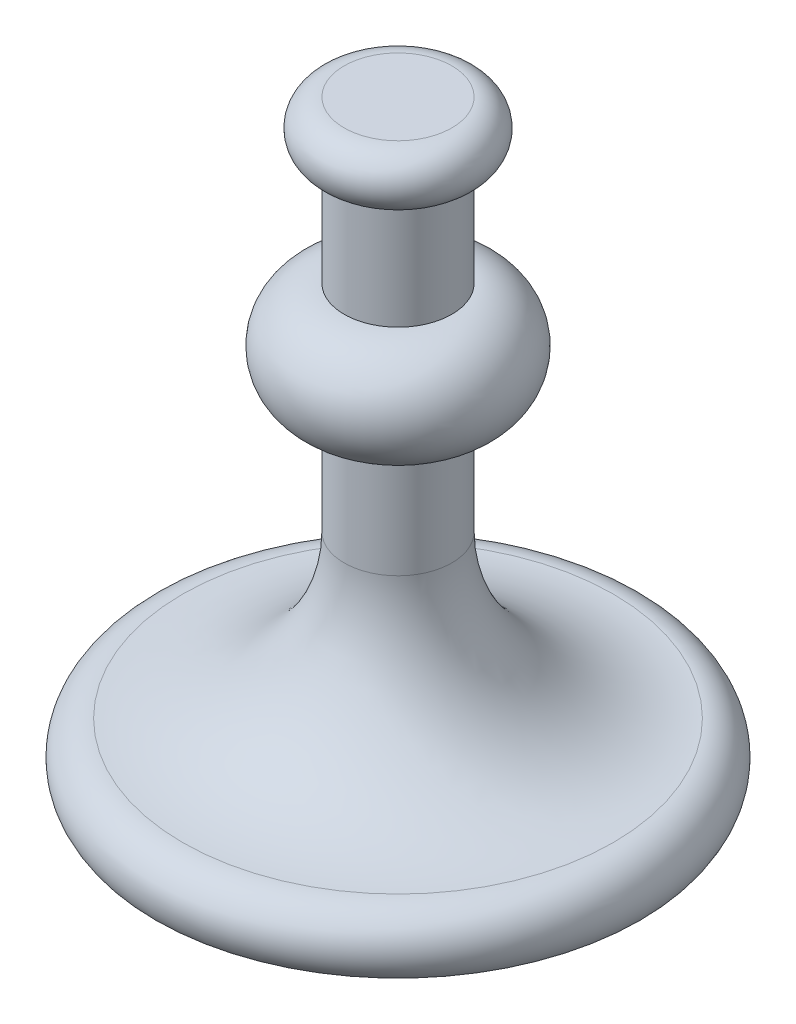
ISO-10303-21;
HEADER;
FILE_DESCRIPTION(('STEP AP214'),'2;1');
FILE_NAME('part.step','',(''),(''),'','','');
FILE_SCHEMA(('AUTOMOTIVE_DESIGN { 1 0 10303 214 1 1 1 1 }'));
ENDSEC;
DATA;
#1=APPLICATION_CONTEXT('core data for automotive mechanical design processes');
#2=APPLICATION_PROTOCOL_DEFINITION('international standard','automotive_design',2000,#1);
#3=PRODUCT_CONTEXT('',#1,'mechanical');
#4=PRODUCT('Part','Part','',(#3));
#5=PRODUCT_RELATED_PRODUCT_CATEGORY('part','',(#4));
#6=PRODUCT_DEFINITION_FORMATION('','',#4);
#7=PRODUCT_DEFINITION_CONTEXT('part definition',#1,'design');
#8=PRODUCT_DEFINITION('design','',#6,#7);
#9=PRODUCT_DEFINITION_SHAPE('','',#8);
#10=(LENGTH_UNIT() NAMED_UNIT(*) SI_UNIT(.MILLI.,.METRE.));
#11=(NAMED_UNIT(*) PLANE_ANGLE_UNIT() SI_UNIT($,.RADIAN.));
#12=(NAMED_UNIT(*) SI_UNIT($,.STERADIAN.) SOLID_ANGLE_UNIT());
#13=UNCERTAINTY_MEASURE_WITH_UNIT(LENGTH_MEASURE(1.E-05),#10,'distance_accuracy_value','');
#14=(GEOMETRIC_REPRESENTATION_CONTEXT(3) GLOBAL_UNCERTAINTY_ASSIGNED_CONTEXT((#13)) GLOBAL_UNIT_ASSIGNED_CONTEXT((#10,
#11,#12)) REPRESENTATION_CONTEXT('',''));
#15=CARTESIAN_POINT('',(0.,0.,0.));
#16=DIRECTION('',(0.,0.,1.));
#17=DIRECTION('',(1.,0.,0.));
#18=AXIS2_PLACEMENT_3D('',#15,#16,#17);
#19=CARTESIAN_POINT('',(0.,0.,0.));
#20=DIRECTION('',(0.,-1.,0.));
#21=DIRECTION('',(0.,0.,-1.));
#22=AXIS2_PLACEMENT_3D('',#19,#20,#21);
#23=PLANE('',#22);
#24=CARTESIAN_POINT('',(0.,0.,0.));
#25=DIRECTION('',(0.,-1.,0.));
#26=DIRECTION('',(0.,0.,-1.));
#27=AXIS2_PLACEMENT_3D('',#24,#25,#26);
#28=CIRCLE('',#27,90.);
#29=CARTESIAN_POINT('',(0.,0.,-90.));
#30=VERTEX_POINT('',#29);
#31=EDGE_CURVE('E59',#30,#30,#28,.T.);
#32=ORIENTED_EDGE('',*,*,#31,.T.);
#33=EDGE_LOOP('',(#32));
#34=FACE_BOUND('',#33,.T.);
#35=ADVANCED_FACE('F34',(#34),#23,.T.);
#36=CARTESIAN_POINT('',(0.,220.,0.));
#37=DIRECTION('',(0.,1.,0.));
#38=DIRECTION('',(0.,0.,1.));
#39=AXIS2_PLACEMENT_3D('',#36,#37,#38);
#40=PLANE('',#39);
#41=CARTESIAN_POINT('',(0.,220.,0.));
#42=DIRECTION('',(0.,-1.,0.));
#43=DIRECTION('',(0.,0.,-1.));
#44=AXIS2_PLACEMENT_3D('',#41,#42,#43);
#45=CIRCLE('',#44,20.);
#46=CARTESIAN_POINT('',(0.,220.,-20.));
#47=VERTEX_POINT('',#46);
#48=EDGE_CURVE('E10',#47,#47,#45,.T.);
#49=ORIENTED_EDGE('',*,*,#48,.F.);
#50=EDGE_LOOP('',(#49));
#51=FACE_BOUND('',#50,.T.);
#52=ADVANCED_FACE('F76',(#51),#40,.T.);
#53=CARTESIAN_POINT('',(0.,210.,0.));
#54=DIRECTION('',(0.,-1.,0.));
#55=DIRECTION('',(0.,0.,-1.));
#56=AXIS2_PLACEMENT_3D('',#53,#54,#55);
#57=TOROIDAL_SURFACE('',#56,20.,10.);
#58=ORIENTED_EDGE('',*,*,#48,.T.);
#59=EDGE_LOOP('',(#58));
#60=FACE_BOUND('',#59,.T.);
#61=CARTESIAN_POINT('',(0.,200.,0.));
#62=DIRECTION('',(0.,-1.,0.));
#63=DIRECTION('',(0.,0.,-1.));
#64=AXIS2_PLACEMENT_3D('',#61,#62,#63);
#65=CIRCLE('',#64,20.);
#66=CARTESIAN_POINT('',(0.,200.,-20.));
#67=VERTEX_POINT('',#66);
#68=EDGE_CURVE('E40',#67,#67,#65,.T.);
#69=ORIENTED_EDGE('',*,*,#68,.F.);
#70=EDGE_LOOP('',(#69));
#71=FACE_BOUND('',#70,.T.);
#72=ADVANCED_FACE('F80',(#60,#71),#57,.T.);
#73=CARTESIAN_POINT('',(0.,220.,0.));
#74=DIRECTION('',(0.,-1.,0.));
#75=DIRECTION('',(0.,0.,-1.));
#76=AXIS2_PLACEMENT_3D('',#73,#74,#75);
#77=CYLINDRICAL_SURFACE('',#76,20.);
#78=ORIENTED_EDGE('',*,*,#68,.T.);
#79=EDGE_LOOP('',(#78));
#80=FACE_BOUND('',#79,.T.);
#81=CARTESIAN_POINT('',(0.,160.,0.));
#82=DIRECTION('',(0.,-1.,0.));
#83=DIRECTION('',(0.,0.,-1.));
#84=AXIS2_PLACEMENT_3D('',#81,#82,#83);
#85=CIRCLE('',#84,20.);
#86=CARTESIAN_POINT('',(0.,160.,-20.));
#87=VERTEX_POINT('',#86);
#88=EDGE_CURVE('E44',#87,#87,#85,.T.);
#89=ORIENTED_EDGE('',*,*,#88,.F.);
#90=EDGE_LOOP('',(#89));
#91=FACE_BOUND('',#90,.T.);
#92=ADVANCED_FACE('F85',(#80,#91),#77,.T.);
#93=CARTESIAN_POINT('',(0.,140.,0.));
#94=DIRECTION('',(0.,-1.,0.));
#95=DIRECTION('',(0.,0.,-1.));
#96=AXIS2_PLACEMENT_3D('',#93,#94,#95);
#97=DEGENERATE_TOROIDAL_SURFACE('',#96,20.,20.,.T.);
#98=ORIENTED_EDGE('',*,*,#88,.T.);
#99=EDGE_LOOP('',(#98));
#100=FACE_BOUND('',#99,.T.);
#101=CARTESIAN_POINT('',(0.,120.,0.));
#102=DIRECTION('',(0.,-1.,0.));
#103=DIRECTION('',(0.,0.,-1.));
#104=AXIS2_PLACEMENT_3D('',#101,#102,#103);
#105=CIRCLE('',#104,20.);
#106=CARTESIAN_POINT('',(0.,120.,-20.));
#107=VERTEX_POINT('',#106);
#108=EDGE_CURVE('E48',#107,#107,#105,.T.);
#109=ORIENTED_EDGE('',*,*,#108,.F.);
#110=EDGE_LOOP('',(#109));
#111=FACE_BOUND('',#110,.T.);
#112=ADVANCED_FACE('F90',(#100,#111),#97,.T.);
#113=CARTESIAN_POINT('',(0.,220.,0.));
#114=DIRECTION('',(0.,-1.,0.));
#115=DIRECTION('',(0.,0.,-1.));
#116=AXIS2_PLACEMENT_3D('',#113,#114,#115);
#117=CYLINDRICAL_SURFACE('',#116,20.);
#118=ORIENTED_EDGE('',*,*,#108,.T.);
#119=EDGE_LOOP('',(#118));
#120=FACE_BOUND('',#119,.T.);
#121=CARTESIAN_POINT('',(0.,80.0012637843949,0.));
#122=DIRECTION('',(0.,-1.,0.));
#123=DIRECTION('',(0.,0.,-1.));
#124=AXIS2_PLACEMENT_3D('',#121,#122,#123);
#125=CIRCLE('',#124,20.);
#126=CARTESIAN_POINT('',(0.,80.0012637843949,-20.));
#127=VERTEX_POINT('',#126);
#128=EDGE_CURVE('E53',#127,#127,#125,.T.);
#129=ORIENTED_EDGE('',*,*,#128,.F.);
#130=EDGE_LOOP('',(#129));
#131=FACE_BOUND('',#130,.T.);
#132=ADVANCED_FACE('F72',(#120,#131),#117,.T.);
#133=CARTESIAN_POINT('',(0.,80.0012637843949,0.));
#134=DIRECTION('',(0.,-1.,0.));
#135=DIRECTION('',(0.,0.,-1.));
#136=AXIS2_PLACEMENT_3D('',#133,#134,#135);
#137=TOROIDAL_SURFACE('',#136,80.,60.);
#138=ORIENTED_EDGE('',*,*,#128,.T.);
#139=EDGE_LOOP('',(#138));
#140=FACE_BOUND('',#139,.T.);
#141=CARTESIAN_POINT('',(0.,20.0012637843948,0.));
#142=DIRECTION('',(0.,-1.,0.));
#143=DIRECTION('',(0.,0.,-1.));
#144=AXIS2_PLACEMENT_3D('',#141,#142,#143);
#145=CIRCLE('',#144,80.);
#146=CARTESIAN_POINT('',(0.,20.0012637843948,-80.));
#147=VERTEX_POINT('',#146);
#148=EDGE_CURVE('E56',#147,#147,#145,.T.);
#149=ORIENTED_EDGE('',*,*,#148,.F.);
#150=EDGE_LOOP('',(#149));
#151=FACE_BOUND('',#150,.T.);
#152=ADVANCED_FACE('F66',(#140,#151),#137,.F.);
#153=CARTESIAN_POINT('',(0.,7.50078985526522,0.));
#154=DIRECTION('',(0.,-1.,0.));
#155=DIRECTION('',(0.,0.,-1.));
#156=AXIS2_PLACEMENT_3D('',#153,#154,#155);
#157=TOROIDAL_SURFACE('',#156,80.,12.5004739291296);
#158=ORIENTED_EDGE('',*,*,#148,.T.);
#159=EDGE_LOOP('',(#158));
#160=FACE_BOUND('',#159,.T.);
#161=ORIENTED_EDGE('',*,*,#31,.F.);
#162=EDGE_LOOP('',(#161));
#163=FACE_BOUND('',#162,.T.);
#164=ADVANCED_FACE('F64',(#160,#163),#157,.T.);
#165=CLOSED_SHELL('',(#35,#52,#72,#92,#112,#132,#152,#164));
#166=MANIFOLD_SOLID_BREP('B2',#165);
#167=ADVANCED_BREP_SHAPE_REPRESENTATION('',(#18,#166),#14);
#168=SHAPE_DEFINITION_REPRESENTATION(#9,#167);
ENDSEC;
END-ISO-10303-21;
